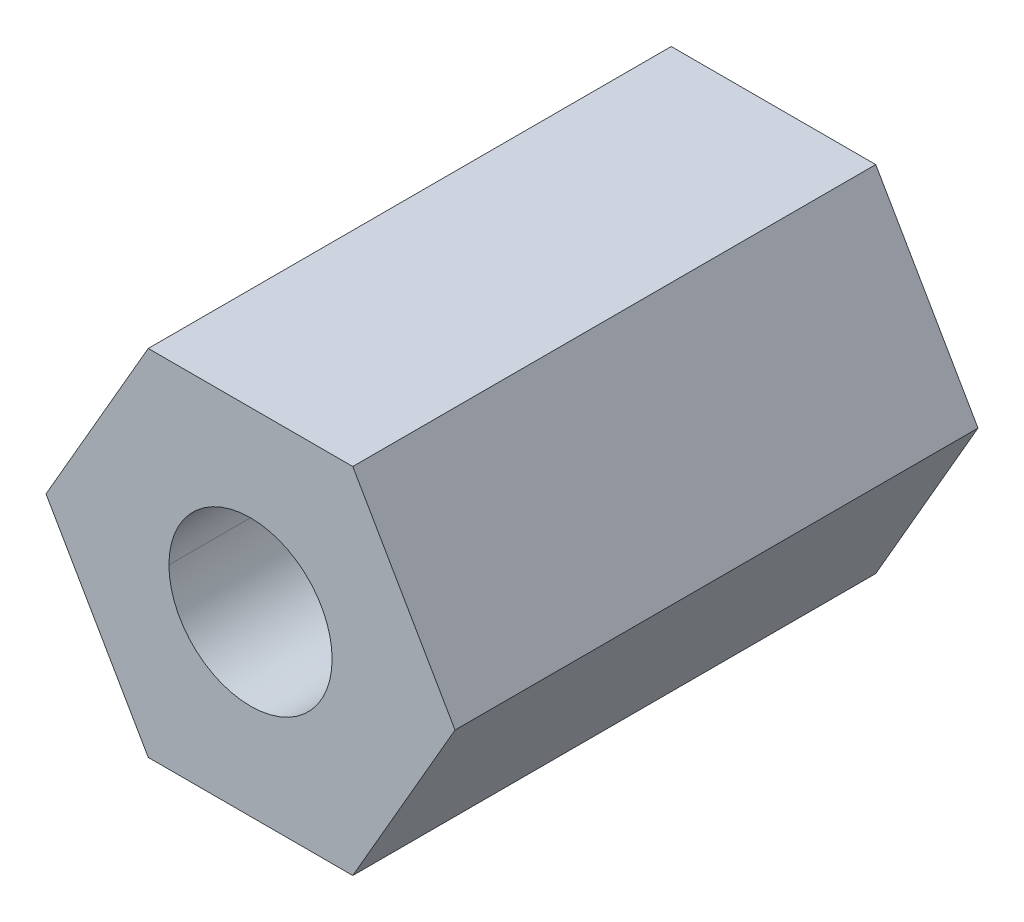
ISO-10303-21;
HEADER;
FILE_DESCRIPTION(('STEP AP214'),'2;1');
FILE_NAME('part.step','',(''),(''),'','','');
FILE_SCHEMA(('AUTOMOTIVE_DESIGN { 1 0 10303 214 1 1 1 1 }'));
ENDSEC;
DATA;
#1=APPLICATION_CONTEXT('core data for automotive mechanical design processes');
#2=APPLICATION_PROTOCOL_DEFINITION('international standard','automotive_design',2000,#1);
#3=PRODUCT_CONTEXT('',#1,'mechanical');
#4=PRODUCT('Part','Part','',(#3));
#5=PRODUCT_RELATED_PRODUCT_CATEGORY('part','',(#4));
#6=PRODUCT_DEFINITION_FORMATION('','',#4);
#7=PRODUCT_DEFINITION_CONTEXT('part definition',#1,'design');
#8=PRODUCT_DEFINITION('design','',#6,#7);
#9=PRODUCT_DEFINITION_SHAPE('','',#8);
#10=(LENGTH_UNIT() NAMED_UNIT(*) SI_UNIT(.MILLI.,.METRE.));
#11=(NAMED_UNIT(*) PLANE_ANGLE_UNIT() SI_UNIT($,.RADIAN.));
#12=(NAMED_UNIT(*) SI_UNIT($,.STERADIAN.) SOLID_ANGLE_UNIT());
#13=UNCERTAINTY_MEASURE_WITH_UNIT(LENGTH_MEASURE(1.E-05),#10,'distance_accuracy_value','');
#14=(GEOMETRIC_REPRESENTATION_CONTEXT(3) GLOBAL_UNCERTAINTY_ASSIGNED_CONTEXT((#13)) GLOBAL_UNIT_ASSIGNED_CONTEXT((#10,
#11,#12)) REPRESENTATION_CONTEXT('',''));
#15=CARTESIAN_POINT('',(0.,0.,0.));
#16=DIRECTION('',(0.,0.,1.));
#17=DIRECTION('',(1.,0.,0.));
#18=AXIS2_PLACEMENT_3D('',#15,#16,#17);
#19=CARTESIAN_POINT('',(0.,0.,-1.01835));
#20=DIRECTION('',(0.,0.,1.));
#21=DIRECTION('',(-1.,0.,0.));
#22=AXIS2_PLACEMENT_3D('',#19,#20,#21);
#23=CYLINDRICAL_SURFACE('',#22,1.025);
#24=DIRECTION('',(0.,0.,1.));
#25=VECTOR('',#24,1.);
#26=CARTESIAN_POINT('',(-1.025,0.,0.));
#27=LINE('',#26,#25);
#28=CARTESIAN_POINT('',(-1.025,0.,0.));
#29=VERTEX_POINT('',#28);
#30=CARTESIAN_POINT('',(-1.025,0.,6.57));
#31=VERTEX_POINT('',#30);
#32=EDGE_CURVE('E11',#29,#31,#27,.T.);
#33=ORIENTED_EDGE('',*,*,#32,.F.);
#34=CARTESIAN_POINT('',(0.,0.,0.));
#35=DIRECTION('',(0.,0.,1.));
#36=DIRECTION('',(1.,0.,0.));
#37=AXIS2_PLACEMENT_3D('',#34,#35,#36);
#38=CIRCLE('',#37,1.025);
#39=CARTESIAN_POINT('',(1.025,0.,0.));
#40=VERTEX_POINT('',#39);
#41=EDGE_CURVE('E192',#40,#29,#38,.T.);
#42=ORIENTED_EDGE('',*,*,#41,.F.);
#43=DIRECTION('',(0.,0.,1.));
#44=VECTOR('',#43,1.);
#45=CARTESIAN_POINT('',(1.025,0.,0.));
#46=LINE('',#45,#44);
#47=CARTESIAN_POINT('',(1.025,0.,6.57));
#48=VERTEX_POINT('',#47);
#49=EDGE_CURVE('E28',#40,#48,#46,.T.);
#50=ORIENTED_EDGE('',*,*,#49,.T.);
#51=CARTESIAN_POINT('',(0.,0.,6.57));
#52=DIRECTION('',(0.,0.,1.));
#53=DIRECTION('',(1.,0.,0.));
#54=AXIS2_PLACEMENT_3D('',#51,#52,#53);
#55=CIRCLE('',#54,1.025);
#56=EDGE_CURVE('E152',#48,#31,#55,.T.);
#57=ORIENTED_EDGE('',*,*,#56,.T.);
#58=EDGE_LOOP('',(#33,#42,#50,#57));
#59=FACE_BOUND('',#58,.T.);
#60=ADVANCED_FACE('F17',(#59),#23,.F.);
#61=CARTESIAN_POINT('',(0.,0.,-1.01835));
#62=DIRECTION('',(0.,0.,1.));
#63=DIRECTION('',(-1.,0.,0.));
#64=AXIS2_PLACEMENT_3D('',#61,#62,#63);
#65=CYLINDRICAL_SURFACE('',#64,1.025);
#66=ORIENTED_EDGE('',*,*,#49,.F.);
#67=CARTESIAN_POINT('',(0.,0.,0.));
#68=DIRECTION('',(0.,0.,1.));
#69=DIRECTION('',(-1.,0.,0.));
#70=AXIS2_PLACEMENT_3D('',#67,#68,#69);
#71=CIRCLE('',#70,1.025);
#72=EDGE_CURVE('E180',#29,#40,#71,.T.);
#73=ORIENTED_EDGE('',*,*,#72,.F.);
#74=ORIENTED_EDGE('',*,*,#32,.T.);
#75=CARTESIAN_POINT('',(0.,0.,6.57));
#76=DIRECTION('',(0.,0.,1.));
#77=DIRECTION('',(-1.,0.,0.));
#78=AXIS2_PLACEMENT_3D('',#75,#76,#77);
#79=CIRCLE('',#78,1.025);
#80=EDGE_CURVE('E21',#31,#48,#79,.T.);
#81=ORIENTED_EDGE('',*,*,#80,.T.);
#82=EDGE_LOOP('',(#66,#73,#74,#81));
#83=FACE_BOUND('',#82,.T.);
#84=ADVANCED_FACE('F208',(#83),#65,.F.);
#85=CARTESIAN_POINT('',(0.,0.,6.57));
#86=DIRECTION('',(0.,0.,1.));
#87=DIRECTION('',(1.,0.,0.));
#88=AXIS2_PLACEMENT_3D('',#85,#86,#87);
#89=PLANE('',#88);
#90=ORIENTED_EDGE('',*,*,#56,.F.);
#91=ORIENTED_EDGE('',*,*,#80,.F.);
#92=EDGE_LOOP('',(#90,#91));
#93=FACE_BOUND('',#92,.T.);
#94=DIRECTION('',(1.,0.,0.));
#95=VECTOR('',#94,1.);
#96=CARTESIAN_POINT('',(-1.284604348947,-2.225,6.57));
#97=LINE('',#96,#95);
#98=CARTESIAN_POINT('',(-1.284604348947,-2.225,6.57));
#99=VERTEX_POINT('',#98);
#100=CARTESIAN_POINT('',(1.284604348947,-2.225,6.57));
#101=VERTEX_POINT('',#100);
#102=EDGE_CURVE('E143',#99,#101,#97,.T.);
#103=ORIENTED_EDGE('',*,*,#102,.T.);
#104=DIRECTION('',(0.500000000000017,0.866025403784429,0.));
#105=VECTOR('',#104,1.);
#106=CARTESIAN_POINT('',(1.284604348947,-2.225,6.57));
#107=LINE('',#106,#105);
#108=CARTESIAN_POINT('',(2.569208697894,0.,6.57));
#109=VERTEX_POINT('',#108);
#110=EDGE_CURVE('E144',#101,#109,#107,.T.);
#111=ORIENTED_EDGE('',*,*,#110,.T.);
#112=DIRECTION('',(-0.500000000000017,0.866025403784429,0.));
#113=VECTOR('',#112,1.);
#114=CARTESIAN_POINT('',(2.569208697894,0.,6.57));
#115=LINE('',#114,#113);
#116=CARTESIAN_POINT('',(1.284604348947,2.225,6.57));
#117=VERTEX_POINT('',#116);
#118=EDGE_CURVE('E164',#109,#117,#115,.T.);
#119=ORIENTED_EDGE('',*,*,#118,.T.);
#120=DIRECTION('',(-1.,0.,0.));
#121=VECTOR('',#120,1.);
#122=CARTESIAN_POINT('',(1.284604348947,2.225,6.57));
#123=LINE('',#122,#121);
#124=CARTESIAN_POINT('',(-1.284604348947,2.225,6.57));
#125=VERTEX_POINT('',#124);
#126=EDGE_CURVE('E109',#117,#125,#123,.T.);
#127=ORIENTED_EDGE('',*,*,#126,.T.);
#128=DIRECTION('',(-0.500000000000017,-0.866025403784429,0.));
#129=VECTOR('',#128,1.);
#130=CARTESIAN_POINT('',(-1.284604348947,2.225,6.57));
#131=LINE('',#130,#129);
#132=CARTESIAN_POINT('',(-2.569208697894,0.,6.57));
#133=VERTEX_POINT('',#132);
#134=EDGE_CURVE('E105',#125,#133,#131,.T.);
#135=ORIENTED_EDGE('',*,*,#134,.T.);
#136=DIRECTION('',(0.500000000000017,-0.866025403784429,0.));
#137=VECTOR('',#136,1.);
#138=CARTESIAN_POINT('',(-2.569208697894,0.,6.57));
#139=LINE('',#138,#137);
#140=EDGE_CURVE('E173',#133,#99,#139,.T.);
#141=ORIENTED_EDGE('',*,*,#140,.T.);
#142=EDGE_LOOP('',(#103,#111,#119,#127,#135,#141));
#143=FACE_BOUND('',#142,.T.);
#144=ADVANCED_FACE('F210',(#93,#143),#89,.T.);
#145=CARTESIAN_POINT('',(-1.284604348947,-2.225,0.));
#146=DIRECTION('',(0.,-1.,0.));
#147=DIRECTION('',(0.,0.,-1.));
#148=AXIS2_PLACEMENT_3D('',#145,#146,#147);
#149=PLANE('',#148);
#150=DIRECTION('',(0.,0.,1.));
#151=VECTOR('',#150,1.);
#152=CARTESIAN_POINT('',(1.284604348947,-2.225,0.));
#153=LINE('',#152,#151);
#154=CARTESIAN_POINT('',(1.284604348947,-2.225,0.));
#155=VERTEX_POINT('',#154);
#156=EDGE_CURVE('E140',#155,#101,#153,.T.);
#157=ORIENTED_EDGE('',*,*,#156,.T.);
#158=ORIENTED_EDGE('',*,*,#102,.F.);
#159=DIRECTION('',(0.,0.,1.));
#160=VECTOR('',#159,1.);
#161=CARTESIAN_POINT('',(-1.284604348947,-2.225,0.));
#162=LINE('',#161,#160);
#163=CARTESIAN_POINT('',(-1.284604348947,-2.225,0.));
#164=VERTEX_POINT('',#163);
#165=EDGE_CURVE('E177',#164,#99,#162,.T.);
#166=ORIENTED_EDGE('',*,*,#165,.F.);
#167=DIRECTION('',(1.,0.,0.));
#168=VECTOR('',#167,1.);
#169=CARTESIAN_POINT('',(-1.284604348947,-2.225,0.));
#170=LINE('',#169,#168);
#171=EDGE_CURVE('E139',#164,#155,#170,.T.);
#172=ORIENTED_EDGE('',*,*,#171,.T.);
#173=EDGE_LOOP('',(#157,#158,#166,#172));
#174=FACE_BOUND('',#173,.T.);
#175=ADVANCED_FACE('F358',(#174),#149,.T.);
#176=CARTESIAN_POINT('',(1.284604348947,-2.225,0.));
#177=DIRECTION('',(0.866025403784429,-0.500000000000017,0.));
#178=DIRECTION('',(0.,0.,-1.));
#179=AXIS2_PLACEMENT_3D('',#176,#177,#178);
#180=PLANE('',#179);
#181=DIRECTION('',(0.,0.,1.));
#182=VECTOR('',#181,1.);
#183=CARTESIAN_POINT('',(2.569208697894,0.,0.));
#184=LINE('',#183,#182);
#185=CARTESIAN_POINT('',(2.569208697894,0.,0.));
#186=VERTEX_POINT('',#185);
#187=EDGE_CURVE('E155',#186,#109,#184,.T.);
#188=ORIENTED_EDGE('',*,*,#187,.T.);
#189=ORIENTED_EDGE('',*,*,#110,.F.);
#190=ORIENTED_EDGE('',*,*,#156,.F.);
#191=DIRECTION('',(0.500000000000017,0.866025403784429,0.));
#192=VECTOR('',#191,1.);
#193=CARTESIAN_POINT('',(1.284604348947,-2.225,0.));
#194=LINE('',#193,#192);
#195=EDGE_CURVE('E137',#155,#186,#194,.T.);
#196=ORIENTED_EDGE('',*,*,#195,.T.);
#197=EDGE_LOOP('',(#188,#189,#190,#196));
#198=FACE_BOUND('',#197,.T.);
#199=ADVANCED_FACE('F353',(#198),#180,.T.);
#200=CARTESIAN_POINT('',(2.569208697894,0.,0.));
#201=DIRECTION('',(0.866025403784429,0.500000000000017,0.));
#202=DIRECTION('',(0.,0.,-1.));
#203=AXIS2_PLACEMENT_3D('',#200,#201,#202);
#204=PLANE('',#203);
#205=DIRECTION('',(0.,0.,1.));
#206=VECTOR('',#205,1.);
#207=CARTESIAN_POINT('',(1.284604348947,2.225,0.));
#208=LINE('',#207,#206);
#209=CARTESIAN_POINT('',(1.284604348947,2.225,0.));
#210=VERTEX_POINT('',#209);
#211=EDGE_CURVE('E115',#210,#117,#208,.T.);
#212=ORIENTED_EDGE('',*,*,#211,.T.);
#213=ORIENTED_EDGE('',*,*,#118,.F.);
#214=ORIENTED_EDGE('',*,*,#187,.F.);
#215=DIRECTION('',(-0.500000000000017,0.866025403784429,0.));
#216=VECTOR('',#215,1.);
#217=CARTESIAN_POINT('',(2.569208697894,0.,0.));
#218=LINE('',#217,#216);
#219=EDGE_CURVE('E120',#186,#210,#218,.T.);
#220=ORIENTED_EDGE('',*,*,#219,.T.);
#221=EDGE_LOOP('',(#212,#213,#214,#220));
#222=FACE_BOUND('',#221,.T.);
#223=ADVANCED_FACE('F19',(#222),#204,.T.);
#224=CARTESIAN_POINT('',(1.284604348947,2.225,0.));
#225=DIRECTION('',(0.,1.,0.));
#226=DIRECTION('',(1.,0.,0.));
#227=AXIS2_PLACEMENT_3D('',#224,#225,#226);
#228=PLANE('',#227);
#229=DIRECTION('',(0.,0.,1.));
#230=VECTOR('',#229,1.);
#231=CARTESIAN_POINT('',(-1.284604348947,2.225,0.));
#232=LINE('',#231,#230);
#233=CARTESIAN_POINT('',(-1.284604348947,2.225,0.));
#234=VERTEX_POINT('',#233);
#235=EDGE_CURVE('E99',#234,#125,#232,.T.);
#236=ORIENTED_EDGE('',*,*,#235,.T.);
#237=ORIENTED_EDGE('',*,*,#126,.F.);
#238=ORIENTED_EDGE('',*,*,#211,.F.);
#239=DIRECTION('',(-1.,0.,0.));
#240=VECTOR('',#239,1.);
#241=CARTESIAN_POINT('',(1.284604348947,2.225,0.));
#242=LINE('',#241,#240);
#243=EDGE_CURVE('E112',#210,#234,#242,.T.);
#244=ORIENTED_EDGE('',*,*,#243,.T.);
#245=EDGE_LOOP('',(#236,#237,#238,#244));
#246=FACE_BOUND('',#245,.T.);
#247=ADVANCED_FACE('F113',(#246),#228,.T.);
#248=CARTESIAN_POINT('',(-1.284604348947,2.225,0.));
#249=DIRECTION('',(-0.866025403784429,0.500000000000017,0.));
#250=DIRECTION('',(0.,0.,1.));
#251=AXIS2_PLACEMENT_3D('',#248,#249,#250);
#252=PLANE('',#251);
#253=DIRECTION('',(0.,0.,1.));
#254=VECTOR('',#253,1.);
#255=CARTESIAN_POINT('',(-2.569208697894,0.,0.));
#256=LINE('',#255,#254);
#257=CARTESIAN_POINT('',(-2.569208697894,0.,0.));
#258=VERTEX_POINT('',#257);
#259=EDGE_CURVE('E170',#258,#133,#256,.T.);
#260=ORIENTED_EDGE('',*,*,#259,.T.);
#261=ORIENTED_EDGE('',*,*,#134,.F.);
#262=ORIENTED_EDGE('',*,*,#235,.F.);
#263=DIRECTION('',(-0.500000000000017,-0.866025403784429,0.));
#264=VECTOR('',#263,1.);
#265=CARTESIAN_POINT('',(-1.284604348947,2.225,0.));
#266=LINE('',#265,#264);
#267=EDGE_CURVE('E104',#234,#258,#266,.T.);
#268=ORIENTED_EDGE('',*,*,#267,.T.);
#269=EDGE_LOOP('',(#260,#261,#262,#268));
#270=FACE_BOUND('',#269,.T.);
#271=ADVANCED_FACE('F102',(#270),#252,.T.);
#272=CARTESIAN_POINT('',(-2.569208697894,0.,0.));
#273=DIRECTION('',(-0.866025403784429,-0.500000000000017,0.));
#274=DIRECTION('',(-0.500000000000017,0.866025403784429,0.));
#275=AXIS2_PLACEMENT_3D('',#272,#273,#274);
#276=PLANE('',#275);
#277=ORIENTED_EDGE('',*,*,#165,.T.);
#278=ORIENTED_EDGE('',*,*,#140,.F.);
#279=ORIENTED_EDGE('',*,*,#259,.F.);
#280=DIRECTION('',(0.500000000000017,-0.866025403784429,0.));
#281=VECTOR('',#280,1.);
#282=CARTESIAN_POINT('',(-2.569208697894,0.,0.));
#283=LINE('',#282,#281);
#284=EDGE_CURVE('E126',#258,#164,#283,.T.);
#285=ORIENTED_EDGE('',*,*,#284,.T.);
#286=EDGE_LOOP('',(#277,#278,#279,#285));
#287=FACE_BOUND('',#286,.T.);
#288=ADVANCED_FACE('F365',(#287),#276,.T.);
#289=CARTESIAN_POINT('',(0.,0.,0.));
#290=DIRECTION('',(0.,0.,1.));
#291=DIRECTION('',(1.,0.,0.));
#292=AXIS2_PLACEMENT_3D('',#289,#290,#291);
#293=PLANE('',#292);
#294=ORIENTED_EDGE('',*,*,#41,.T.);
#295=ORIENTED_EDGE('',*,*,#72,.T.);
#296=EDGE_LOOP('',(#294,#295));
#297=FACE_BOUND('',#296,.T.);
#298=ORIENTED_EDGE('',*,*,#267,.F.);
#299=ORIENTED_EDGE('',*,*,#243,.F.);
#300=ORIENTED_EDGE('',*,*,#219,.F.);
#301=ORIENTED_EDGE('',*,*,#195,.F.);
#302=ORIENTED_EDGE('',*,*,#171,.F.);
#303=ORIENTED_EDGE('',*,*,#284,.F.);
#304=EDGE_LOOP('',(#298,#299,#300,#301,#302,#303));
#305=FACE_BOUND('',#304,.T.);
#306=ADVANCED_FACE('F123',(#297,#305),#293,.F.);
#307=CLOSED_SHELL('',(#60,#84,#144,#175,#199,#223,#247,#271,#288,#306));
#308=MANIFOLD_SOLID_BREP('B1',#307);
#309=ADVANCED_BREP_SHAPE_REPRESENTATION('',(#18,#308),#14);
#310=SHAPE_DEFINITION_REPRESENTATION(#9,#309);
ENDSEC;
END-ISO-10303-21;
